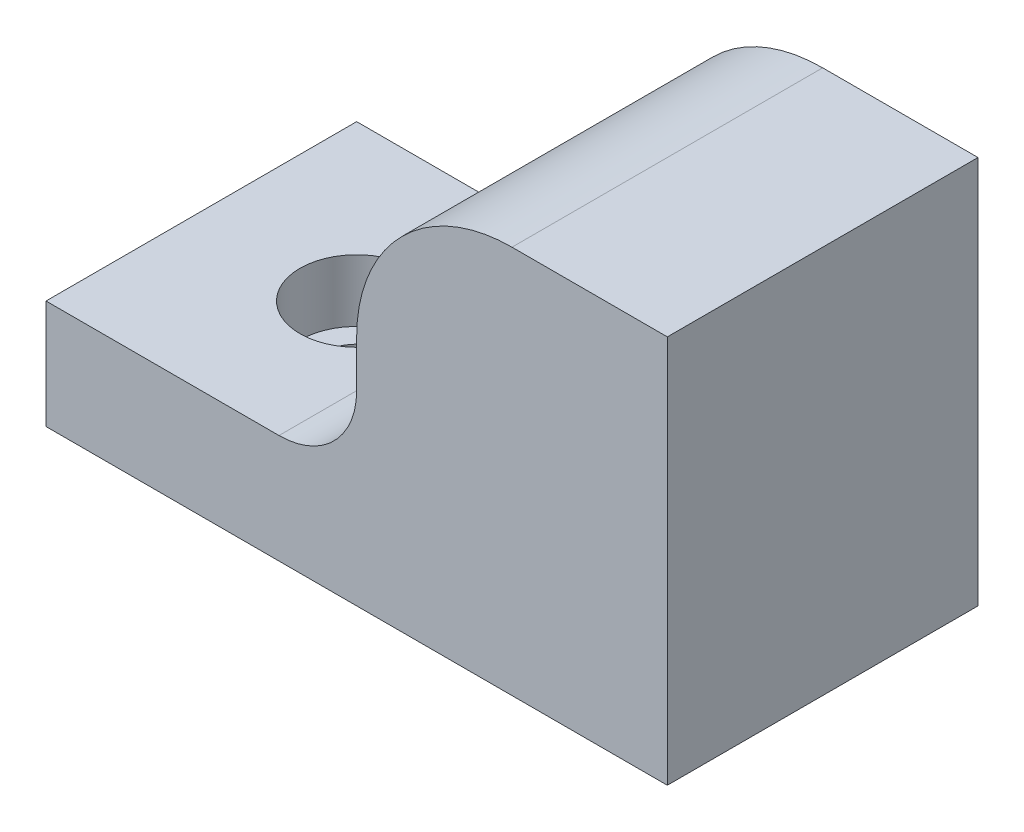
ISO-10303-21;
HEADER;
FILE_DESCRIPTION(('STEP AP214'),'2;1');
FILE_NAME('part.step','',(''),(''),'','','');
FILE_SCHEMA(('AUTOMOTIVE_DESIGN { 1 0 10303 214 1 1 1 1 }'));
ENDSEC;
DATA;
#1=APPLICATION_CONTEXT('core data for automotive mechanical design processes');
#2=APPLICATION_PROTOCOL_DEFINITION('international standard','automotive_design',2000,#1);
#3=PRODUCT_CONTEXT('',#1,'mechanical');
#4=PRODUCT('Part','Part','',(#3));
#5=PRODUCT_RELATED_PRODUCT_CATEGORY('part','',(#4));
#6=PRODUCT_DEFINITION_FORMATION('','',#4);
#7=PRODUCT_DEFINITION_CONTEXT('part definition',#1,'design');
#8=PRODUCT_DEFINITION('design','',#6,#7);
#9=PRODUCT_DEFINITION_SHAPE('','',#8);
#10=(LENGTH_UNIT() NAMED_UNIT(*) SI_UNIT(.MILLI.,.METRE.));
#11=(NAMED_UNIT(*) PLANE_ANGLE_UNIT() SI_UNIT($,.RADIAN.));
#12=(NAMED_UNIT(*) SI_UNIT($,.STERADIAN.) SOLID_ANGLE_UNIT());
#13=UNCERTAINTY_MEASURE_WITH_UNIT(LENGTH_MEASURE(1.E-05),#10,'distance_accuracy_value','');
#14=(GEOMETRIC_REPRESENTATION_CONTEXT(3) GLOBAL_UNCERTAINTY_ASSIGNED_CONTEXT((#13)) GLOBAL_UNIT_ASSIGNED_CONTEXT((#10,
#11,#12)) REPRESENTATION_CONTEXT('',''));
#15=CARTESIAN_POINT('',(0.,0.,0.));
#16=DIRECTION('',(0.,0.,1.));
#17=DIRECTION('',(1.,0.,0.));
#18=AXIS2_PLACEMENT_3D('',#15,#16,#17);
#19=CARTESIAN_POINT('',(0.,0.,10.));
#20=DIRECTION('',(0.,0.,1.));
#21=DIRECTION('',(1.,0.,0.));
#22=AXIS2_PLACEMENT_3D('',#19,#20,#21);
#23=PLANE('',#22);
#24=DIRECTION('',(-1.,0.,0.));
#25=VECTOR('',#24,1.);
#26=CARTESIAN_POINT('',(20.,25.,10.));
#27=LINE('',#26,#25);
#28=CARTESIAN_POINT('',(20.,25.,10.));
#29=VERTEX_POINT('',#28);
#30=CARTESIAN_POINT('',(10.,25.,10.));
#31=VERTEX_POINT('',#30);
#32=EDGE_CURVE('E158',#29,#31,#27,.T.);
#33=ORIENTED_EDGE('',*,*,#32,.T.);
#34=CARTESIAN_POINT('',(10.,15.,10.));
#35=DIRECTION('',(0.,0.,1.));
#36=DIRECTION('',(1.,0.,0.));
#37=AXIS2_PLACEMENT_3D('',#34,#35,#36);
#38=CIRCLE('',#37,10.);
#39=CARTESIAN_POINT('',(0.,15.,10.));
#40=VERTEX_POINT('',#39);
#41=EDGE_CURVE('E12',#31,#40,#38,.T.);
#42=ORIENTED_EDGE('',*,*,#41,.T.);
#43=DIRECTION('',(0.,-1.,0.));
#44=VECTOR('',#43,1.);
#45=CARTESIAN_POINT('',(0.,25.,10.));
#46=LINE('',#45,#44);
#47=CARTESIAN_POINT('',(0.,12.,10.));
#48=VERTEX_POINT('',#47);
#49=EDGE_CURVE('E156',#40,#48,#46,.T.);
#50=ORIENTED_EDGE('',*,*,#49,.T.);
#51=CARTESIAN_POINT('',(-5.,12.,10.));
#52=DIRECTION('',(0.,0.,1.));
#53=DIRECTION('',(1.,0.,0.));
#54=AXIS2_PLACEMENT_3D('',#51,#52,#53);
#55=CIRCLE('',#54,5.);
#56=CARTESIAN_POINT('',(-5.,7.,10.));
#57=VERTEX_POINT('',#56);
#58=EDGE_CURVE('E178',#48,#57,#55,.F.);
#59=ORIENTED_EDGE('',*,*,#58,.T.);
#60=DIRECTION('',(1.,0.,0.));
#61=VECTOR('',#60,1.);
#62=CARTESIAN_POINT('',(0.,7.,10.));
#63=LINE('',#62,#61);
#64=CARTESIAN_POINT('',(-20.,7.,10.));
#65=VERTEX_POINT('',#64);
#66=EDGE_CURVE('E135',#65,#57,#63,.T.);
#67=ORIENTED_EDGE('',*,*,#66,.F.);
#68=DIRECTION('',(0.,-1.,0.));
#69=VECTOR('',#68,1.);
#70=CARTESIAN_POINT('',(-20.,0.,10.));
#71=LINE('',#70,#69);
#72=CARTESIAN_POINT('',(-20.,0.,10.));
#73=VERTEX_POINT('',#72);
#74=EDGE_CURVE('E136',#65,#73,#71,.T.);
#75=ORIENTED_EDGE('',*,*,#74,.T.);
#76=DIRECTION('',(1.,0.,0.));
#77=VECTOR('',#76,1.);
#78=CARTESIAN_POINT('',(0.,0.,10.));
#79=LINE('',#78,#77);
#80=CARTESIAN_POINT('',(20.,0.,10.));
#81=VERTEX_POINT('',#80);
#82=EDGE_CURVE('E124',#73,#81,#79,.T.);
#83=ORIENTED_EDGE('',*,*,#82,.T.);
#84=DIRECTION('',(0.,-1.,0.));
#85=VECTOR('',#84,1.);
#86=CARTESIAN_POINT('',(20.,25.,10.));
#87=LINE('',#86,#85);
#88=EDGE_CURVE('E161',#29,#81,#87,.T.);
#89=ORIENTED_EDGE('',*,*,#88,.F.);
#90=EDGE_LOOP('',(#33,#42,#50,#59,#67,#75,#83,#89));
#91=FACE_BOUND('',#90,.T.);
#92=ADVANCED_FACE('F59',(#91),#23,.T.);
#93=CARTESIAN_POINT('',(-20.,0.,10.));
#94=DIRECTION('',(1.,0.,0.));
#95=DIRECTION('',(0.,0.,-1.));
#96=AXIS2_PLACEMENT_3D('',#93,#94,#95);
#97=PLANE('',#96);
#98=DIRECTION('',(0.,-1.,0.));
#99=VECTOR('',#98,1.);
#100=CARTESIAN_POINT('',(-20.,0.,-10.));
#101=LINE('',#100,#99);
#102=CARTESIAN_POINT('',(-20.,7.,-10.));
#103=VERTEX_POINT('',#102);
#104=CARTESIAN_POINT('',(-20.,0.,-10.));
#105=VERTEX_POINT('',#104);
#106=EDGE_CURVE('E146',#103,#105,#101,.T.);
#107=ORIENTED_EDGE('',*,*,#106,.T.);
#108=DIRECTION('',(0.,0.,-1.));
#109=VECTOR('',#108,1.);
#110=CARTESIAN_POINT('',(-20.,0.,10.));
#111=LINE('',#110,#109);
#112=EDGE_CURVE('E128',#73,#105,#111,.T.);
#113=ORIENTED_EDGE('',*,*,#112,.F.);
#114=ORIENTED_EDGE('',*,*,#74,.F.);
#115=DIRECTION('',(0.,0.,-1.));
#116=VECTOR('',#115,1.);
#117=CARTESIAN_POINT('',(-20.,7.,10.));
#118=LINE('',#117,#116);
#119=EDGE_CURVE('E148',#65,#103,#118,.T.);
#120=ORIENTED_EDGE('',*,*,#119,.T.);
#121=EDGE_LOOP('',(#107,#113,#114,#120));
#122=FACE_BOUND('',#121,.T.);
#123=ADVANCED_FACE('F144',(#122),#97,.F.);
#124=CARTESIAN_POINT('',(0.,0.,-10.));
#125=DIRECTION('',(0.,0.,1.));
#126=DIRECTION('',(1.,0.,0.));
#127=AXIS2_PLACEMENT_3D('',#124,#125,#126);
#128=PLANE('',#127);
#129=CARTESIAN_POINT('',(9.99999999999999,20.,-10.));
#130=DIRECTION('',(0.,0.,1.));
#131=DIRECTION('',(1.,0.,0.));
#132=AXIS2_PLACEMENT_3D('',#129,#130,#131);
#133=CIRCLE('',#132,3.4);
#134=CARTESIAN_POINT('',(13.4,20.,-10.));
#135=VERTEX_POINT('',#134);
#136=EDGE_CURVE('E262',#135,#135,#133,.T.);
#137=ORIENTED_EDGE('',*,*,#136,.T.);
#138=EDGE_LOOP('',(#137));
#139=FACE_BOUND('',#138,.T.);
#140=DIRECTION('',(0.,-1.,0.));
#141=VECTOR('',#140,1.);
#142=CARTESIAN_POINT('',(0.,25.,-10.));
#143=LINE('',#142,#141);
#144=CARTESIAN_POINT('',(0.,15.,-10.));
#145=VERTEX_POINT('',#144);
#146=CARTESIAN_POINT('',(0.,12.,-10.));
#147=VERTEX_POINT('',#146);
#148=EDGE_CURVE('E164',#145,#147,#143,.T.);
#149=ORIENTED_EDGE('',*,*,#148,.F.);
#150=CARTESIAN_POINT('',(10.,15.,-10.));
#151=DIRECTION('',(0.,0.,1.));
#152=DIRECTION('',(1.,0.,0.));
#153=AXIS2_PLACEMENT_3D('',#150,#151,#152);
#154=CIRCLE('',#153,10.);
#155=CARTESIAN_POINT('',(10.,25.,-10.));
#156=VERTEX_POINT('',#155);
#157=EDGE_CURVE('E81',#145,#156,#154,.F.);
#158=ORIENTED_EDGE('',*,*,#157,.T.);
#159=DIRECTION('',(-1.,0.,0.));
#160=VECTOR('',#159,1.);
#161=CARTESIAN_POINT('',(20.,25.,-10.));
#162=LINE('',#161,#160);
#163=CARTESIAN_POINT('',(20.,25.,-10.));
#164=VERTEX_POINT('',#163);
#165=EDGE_CURVE('E166',#164,#156,#162,.T.);
#166=ORIENTED_EDGE('',*,*,#165,.F.);
#167=DIRECTION('',(0.,-1.,0.));
#168=VECTOR('',#167,1.);
#169=CARTESIAN_POINT('',(20.,25.,-10.));
#170=LINE('',#169,#168);
#171=CARTESIAN_POINT('',(20.,0.,-10.));
#172=VERTEX_POINT('',#171);
#173=EDGE_CURVE('E159',#164,#172,#170,.T.);
#174=ORIENTED_EDGE('',*,*,#173,.T.);
#175=DIRECTION('',(1.,0.,0.));
#176=VECTOR('',#175,1.);
#177=CARTESIAN_POINT('',(0.,0.,-10.));
#178=LINE('',#177,#176);
#179=EDGE_CURVE('E202',#105,#172,#178,.T.);
#180=ORIENTED_EDGE('',*,*,#179,.F.);
#181=ORIENTED_EDGE('',*,*,#106,.F.);
#182=DIRECTION('',(1.,0.,0.));
#183=VECTOR('',#182,1.);
#184=CARTESIAN_POINT('',(0.,7.,-10.));
#185=LINE('',#184,#183);
#186=CARTESIAN_POINT('',(-5.,7.,-10.));
#187=VERTEX_POINT('',#186);
#188=EDGE_CURVE('E142',#103,#187,#185,.T.);
#189=ORIENTED_EDGE('',*,*,#188,.T.);
#190=CARTESIAN_POINT('',(-5.,12.,-10.));
#191=DIRECTION('',(0.,0.,1.));
#192=DIRECTION('',(1.,0.,0.));
#193=AXIS2_PLACEMENT_3D('',#190,#191,#192);
#194=CIRCLE('',#193,5.);
#195=EDGE_CURVE('E175',#187,#147,#194,.T.);
#196=ORIENTED_EDGE('',*,*,#195,.T.);
#197=EDGE_LOOP('',(#149,#158,#166,#174,#180,#181,#189,#196));
#198=FACE_BOUND('',#197,.T.);
#199=ADVANCED_FACE('F189',(#139,#198),#128,.F.);
#200=CARTESIAN_POINT('',(0.,7.,10.));
#201=DIRECTION('',(0.,1.,0.));
#202=DIRECTION('',(-1.,0.,0.));
#203=AXIS2_PLACEMENT_3D('',#200,#201,#202);
#204=PLANE('',#203);
#205=CARTESIAN_POINT('',(-10.,7.,0.));
#206=DIRECTION('',(0.,1.,0.));
#207=DIRECTION('',(-1.,0.,0.));
#208=AXIS2_PLACEMENT_3D('',#205,#206,#207);
#209=CIRCLE('',#208,3.65);
#210=CARTESIAN_POINT('',(-13.65,7.,0.));
#211=VERTEX_POINT('',#210);
#212=EDGE_CURVE('E252',#211,#211,#209,.T.);
#213=ORIENTED_EDGE('',*,*,#212,.F.);
#214=EDGE_LOOP('',(#213));
#215=FACE_BOUND('',#214,.T.);
#216=ORIENTED_EDGE('',*,*,#66,.T.);
#217=DIRECTION('',(0.,0.,-1.));
#218=VECTOR('',#217,1.);
#219=CARTESIAN_POINT('',(-5.,7.,10.));
#220=LINE('',#219,#218);
#221=EDGE_CURVE('E147',#57,#187,#220,.T.);
#222=ORIENTED_EDGE('',*,*,#221,.T.);
#223=ORIENTED_EDGE('',*,*,#188,.F.);
#224=ORIENTED_EDGE('',*,*,#119,.F.);
#225=EDGE_LOOP('',(#216,#222,#223,#224));
#226=FACE_BOUND('',#225,.T.);
#227=ADVANCED_FACE('F198',(#215,#226),#204,.T.);
#228=CARTESIAN_POINT('',(0.,0.,10.));
#229=DIRECTION('',(0.,1.,0.));
#230=DIRECTION('',(0.,0.,1.));
#231=AXIS2_PLACEMENT_3D('',#228,#229,#230);
#232=PLANE('',#231);
#233=CARTESIAN_POINT('',(9.99999999999999,0.,0.));
#234=DIRECTION('',(0.,1.,0.));
#235=DIRECTION('',(0.,0.,1.));
#236=AXIS2_PLACEMENT_3D('',#233,#234,#235);
#237=CIRCLE('',#236,3.4);
#238=CARTESIAN_POINT('',(9.99999999999999,0.,3.4));
#239=VERTEX_POINT('',#238);
#240=EDGE_CURVE('E265',#239,#239,#237,.T.);
#241=ORIENTED_EDGE('',*,*,#240,.T.);
#242=EDGE_LOOP('',(#241));
#243=FACE_BOUND('',#242,.T.);
#244=CARTESIAN_POINT('',(-10.,0.,0.));
#245=DIRECTION('',(0.,1.,0.));
#246=DIRECTION('',(0.,0.,1.));
#247=AXIS2_PLACEMENT_3D('',#244,#245,#246);
#248=CIRCLE('',#247,2.25);
#249=CARTESIAN_POINT('',(-10.,0.,2.25));
#250=VERTEX_POINT('',#249);
#251=EDGE_CURVE('E253',#250,#250,#248,.F.);
#252=ORIENTED_EDGE('',*,*,#251,.F.);
#253=EDGE_LOOP('',(#252));
#254=FACE_BOUND('',#253,.T.);
#255=ORIENTED_EDGE('',*,*,#179,.T.);
#256=DIRECTION('',(0.,0.,-1.));
#257=VECTOR('',#256,1.);
#258=CARTESIAN_POINT('',(20.,0.,10.));
#259=LINE('',#258,#257);
#260=EDGE_CURVE('E131',#81,#172,#259,.T.);
#261=ORIENTED_EDGE('',*,*,#260,.F.);
#262=ORIENTED_EDGE('',*,*,#82,.F.);
#263=ORIENTED_EDGE('',*,*,#112,.T.);
#264=EDGE_LOOP('',(#255,#261,#262,#263));
#265=FACE_BOUND('',#264,.T.);
#266=ADVANCED_FACE('F126',(#243,#254,#265),#232,.F.);
#267=CARTESIAN_POINT('',(20.,25.,10.));
#268=DIRECTION('',(1.,0.,0.));
#269=DIRECTION('',(0.,1.,0.));
#270=AXIS2_PLACEMENT_3D('',#267,#268,#269);
#271=PLANE('',#270);
#272=ORIENTED_EDGE('',*,*,#173,.F.);
#273=DIRECTION('',(0.,0.,-1.));
#274=VECTOR('',#273,1.);
#275=CARTESIAN_POINT('',(20.,25.,10.));
#276=LINE('',#275,#274);
#277=EDGE_CURVE('E163',#29,#164,#276,.T.);
#278=ORIENTED_EDGE('',*,*,#277,.F.);
#279=ORIENTED_EDGE('',*,*,#88,.T.);
#280=ORIENTED_EDGE('',*,*,#260,.T.);
#281=EDGE_LOOP('',(#272,#278,#279,#280));
#282=FACE_BOUND('',#281,.T.);
#283=ADVANCED_FACE('F205',(#282),#271,.T.);
#284=CARTESIAN_POINT('',(20.,25.,10.));
#285=DIRECTION('',(0.,-1.,0.));
#286=DIRECTION('',(1.,0.,0.));
#287=AXIS2_PLACEMENT_3D('',#284,#285,#286);
#288=PLANE('',#287);
#289=ORIENTED_EDGE('',*,*,#165,.T.);
#290=DIRECTION('',(0.,0.,-1.));
#291=VECTOR('',#290,1.);
#292=CARTESIAN_POINT('',(10.,25.,10.));
#293=LINE('',#292,#291);
#294=EDGE_CURVE('E67',#156,#31,#293,.F.);
#295=ORIENTED_EDGE('',*,*,#294,.T.);
#296=ORIENTED_EDGE('',*,*,#32,.F.);
#297=ORIENTED_EDGE('',*,*,#277,.T.);
#298=EDGE_LOOP('',(#289,#295,#296,#297));
#299=FACE_BOUND('',#298,.T.);
#300=ADVANCED_FACE('F206',(#299),#288,.F.);
#301=CARTESIAN_POINT('',(0.,25.,10.));
#302=DIRECTION('',(1.,0.,0.));
#303=DIRECTION('',(0.,1.,0.));
#304=AXIS2_PLACEMENT_3D('',#301,#302,#303);
#305=PLANE('',#304);
#306=ORIENTED_EDGE('',*,*,#49,.F.);
#307=DIRECTION('',(0.,0.,-1.));
#308=VECTOR('',#307,1.);
#309=CARTESIAN_POINT('',(0.,15.,10.));
#310=LINE('',#309,#308);
#311=EDGE_CURVE('E180',#40,#145,#310,.T.);
#312=ORIENTED_EDGE('',*,*,#311,.T.);
#313=ORIENTED_EDGE('',*,*,#148,.T.);
#314=DIRECTION('',(0.,0.,-1.));
#315=VECTOR('',#314,1.);
#316=CARTESIAN_POINT('',(0.,12.,10.));
#317=LINE('',#316,#315);
#318=EDGE_CURVE('E151',#147,#48,#317,.F.);
#319=ORIENTED_EDGE('',*,*,#318,.T.);
#320=EDGE_LOOP('',(#306,#312,#313,#319));
#321=FACE_BOUND('',#320,.T.);
#322=ADVANCED_FACE('F186',(#321),#305,.F.);
#323=CARTESIAN_POINT('',(-10.,3.,0.));
#324=DIRECTION('',(0.,1.,0.));
#325=DIRECTION('',(-1.,0.,0.));
#326=AXIS2_PLACEMENT_3D('',#323,#324,#325);
#327=CYLINDRICAL_SURFACE('',#326,3.65);
#328=CARTESIAN_POINT('',(-10.,3.,0.));
#329=DIRECTION('',(0.,1.,0.));
#330=DIRECTION('',(-1.,0.,0.));
#331=AXIS2_PLACEMENT_3D('',#328,#329,#330);
#332=CIRCLE('',#331,3.65);
#333=CARTESIAN_POINT('',(-13.65,3.,0.));
#334=VERTEX_POINT('',#333);
#335=EDGE_CURVE('E167',#334,#334,#332,.T.);
#336=ORIENTED_EDGE('',*,*,#335,.F.);
#337=EDGE_LOOP('',(#336));
#338=FACE_BOUND('',#337,.T.);
#339=ORIENTED_EDGE('',*,*,#212,.T.);
#340=EDGE_LOOP('',(#339));
#341=FACE_BOUND('',#340,.T.);
#342=ADVANCED_FACE('F221',(#338,#341),#327,.F.);
#343=CARTESIAN_POINT('',(-10.,3.,0.));
#344=DIRECTION('',(0.,1.,0.));
#345=DIRECTION('',(-1.,0.,0.));
#346=AXIS2_PLACEMENT_3D('',#343,#344,#345);
#347=PLANE('',#346);
#348=CARTESIAN_POINT('',(-10.,3.,0.));
#349=DIRECTION('',(0.,1.,0.));
#350=DIRECTION('',(-1.,0.,0.));
#351=AXIS2_PLACEMENT_3D('',#348,#349,#350);
#352=CIRCLE('',#351,2.25);
#353=CARTESIAN_POINT('',(-12.25,3.,0.));
#354=VERTEX_POINT('',#353);
#355=EDGE_CURVE('E257',#354,#354,#352,.T.);
#356=ORIENTED_EDGE('',*,*,#355,.F.);
#357=EDGE_LOOP('',(#356));
#358=FACE_BOUND('',#357,.T.);
#359=ORIENTED_EDGE('',*,*,#335,.T.);
#360=EDGE_LOOP('',(#359));
#361=FACE_BOUND('',#360,.T.);
#362=ADVANCED_FACE('F240',(#358,#361),#347,.T.);
#363=CARTESIAN_POINT('',(-10.,-0.00100000000000534,0.));
#364=DIRECTION('',(0.,1.,0.));
#365=DIRECTION('',(-1.,0.,0.));
#366=AXIS2_PLACEMENT_3D('',#363,#364,#365);
#367=CYLINDRICAL_SURFACE('',#366,2.25);
#368=ORIENTED_EDGE('',*,*,#355,.T.);
#369=EDGE_LOOP('',(#368));
#370=FACE_BOUND('',#369,.T.);
#371=ORIENTED_EDGE('',*,*,#251,.T.);
#372=EDGE_LOOP('',(#371));
#373=FACE_BOUND('',#372,.T.);
#374=ADVANCED_FACE('F245',(#370,#373),#367,.F.);
#375=CARTESIAN_POINT('',(9.99999999999999,-4.,0.));
#376=DIRECTION('',(0.,1.,0.));
#377=DIRECTION('',(0.,0.,1.));
#378=AXIS2_PLACEMENT_3D('',#375,#376,#377);
#379=CYLINDRICAL_SURFACE('',#378,3.4);
#380=ORIENTED_EDGE('',*,*,#240,.F.);
#381=EDGE_LOOP('',(#380));
#382=FACE_BOUND('',#381,.T.);
#383=CARTESIAN_POINT('',(9.99999999999999,12.,0.));
#384=DIRECTION('',(0.,-1.,0.));
#385=DIRECTION('',(1.,0.,0.));
#386=AXIS2_PLACEMENT_3D('',#383,#384,#385);
#387=CIRCLE('',#386,3.4);
#388=CARTESIAN_POINT('',(9.99999999999999,12.,3.4));
#389=VERTEX_POINT('',#388);
#390=EDGE_CURVE('E271',#389,#389,#387,.T.);
#391=ORIENTED_EDGE('',*,*,#390,.F.);
#392=EDGE_LOOP('',(#391));
#393=FACE_BOUND('',#392,.T.);
#394=ADVANCED_FACE('F212',(#382,#393),#379,.F.);
#395=CARTESIAN_POINT('',(9.99999999999999,12.,-7.99999999999999));
#396=DIRECTION('',(-1.,0.,0.));
#397=DIRECTION('',(0.,0.,1.));
#398=AXIS2_PLACEMENT_3D('',#395,#396,#397);
#399=TOROIDAL_SURFACE('',#398,7.99999999999999,3.4);
#400=CARTESIAN_POINT('',(9.99999999999999,20.,-7.99999999999999));
#401=DIRECTION('',(0.,0.,1.));
#402=DIRECTION('',(1.,0.,0.));
#403=AXIS2_PLACEMENT_3D('',#400,#401,#402);
#404=CIRCLE('',#403,3.4);
#405=CARTESIAN_POINT('',(9.99999999999999,23.4,-7.99999999999999));
#406=VERTEX_POINT('',#405);
#407=EDGE_CURVE('E268',#406,#406,#404,.T.);
#408=CARTESIAN_POINT('',(9.99999999999999,12.,-7.99999999999999));
#409=DIRECTION('',(-1.,0.,0.));
#410=DIRECTION('',(0.,0.,1.));
#411=AXIS2_PLACEMENT_3D('',#408,#409,#410);
#412=CIRCLE('',#411,11.4);
#413=EDGE_CURVE('',#389,#406,#412,.T.);
#414=ORIENTED_EDGE('',*,*,#390,.T.);
#415=ORIENTED_EDGE('',*,*,#407,.F.);
#416=ORIENTED_EDGE('',*,*,#413,.T.);
#417=ORIENTED_EDGE('',*,*,#413,.F.);
#418=EDGE_LOOP('',(#414,#416,#415,#417));
#419=FACE_BOUND('',#418,.T.);
#420=ADVANCED_FACE('F275',(#419),#399,.F.);
#421=CARTESIAN_POINT('',(9.99999999999999,20.,-7.99999999999999));
#422=DIRECTION('',(0.,0.,-1.));
#423=DIRECTION('',(-1.,0.,0.));
#424=AXIS2_PLACEMENT_3D('',#421,#422,#423);
#425=CYLINDRICAL_SURFACE('',#424,3.4);
#426=ORIENTED_EDGE('',*,*,#136,.F.);
#427=EDGE_LOOP('',(#426));
#428=FACE_BOUND('',#427,.T.);
#429=ORIENTED_EDGE('',*,*,#407,.T.);
#430=EDGE_LOOP('',(#429));
#431=FACE_BOUND('',#430,.T.);
#432=ADVANCED_FACE('F211',(#428,#431),#425,.F.);
#433=CARTESIAN_POINT('',(-5.,12.,10.));
#434=DIRECTION('',(0.,0.,-1.));
#435=DIRECTION('',(-1.,0.,0.));
#436=AXIS2_PLACEMENT_3D('',#433,#434,#435);
#437=CYLINDRICAL_SURFACE('',#436,5.);
#438=ORIENTED_EDGE('',*,*,#58,.F.);
#439=ORIENTED_EDGE('',*,*,#318,.F.);
#440=ORIENTED_EDGE('',*,*,#195,.F.);
#441=ORIENTED_EDGE('',*,*,#221,.F.);
#442=EDGE_LOOP('',(#438,#439,#440,#441));
#443=FACE_BOUND('',#442,.T.);
#444=ADVANCED_FACE('F196',(#443),#437,.F.);
#445=CARTESIAN_POINT('',(10.,15.,10.));
#446=DIRECTION('',(0.,0.,-1.));
#447=DIRECTION('',(-1.,0.,0.));
#448=AXIS2_PLACEMENT_3D('',#445,#446,#447);
#449=CYLINDRICAL_SURFACE('',#448,10.);
#450=ORIENTED_EDGE('',*,*,#41,.F.);
#451=ORIENTED_EDGE('',*,*,#294,.F.);
#452=ORIENTED_EDGE('',*,*,#157,.F.);
#453=ORIENTED_EDGE('',*,*,#311,.F.);
#454=EDGE_LOOP('',(#450,#451,#452,#453));
#455=FACE_BOUND('',#454,.T.);
#456=ADVANCED_FACE('F61',(#455),#449,.T.);
#457=CLOSED_SHELL('',(#92,#123,#199,#227,#266,#283,#300,#322,#342,#362,#374,#394,#420,#432,#444,#456));
#458=MANIFOLD_SOLID_BREP('B2',#457);
#459=ADVANCED_BREP_SHAPE_REPRESENTATION('',(#18,#458),#14);
#460=SHAPE_DEFINITION_REPRESENTATION(#9,#459);
ENDSEC;
END-ISO-10303-21;
